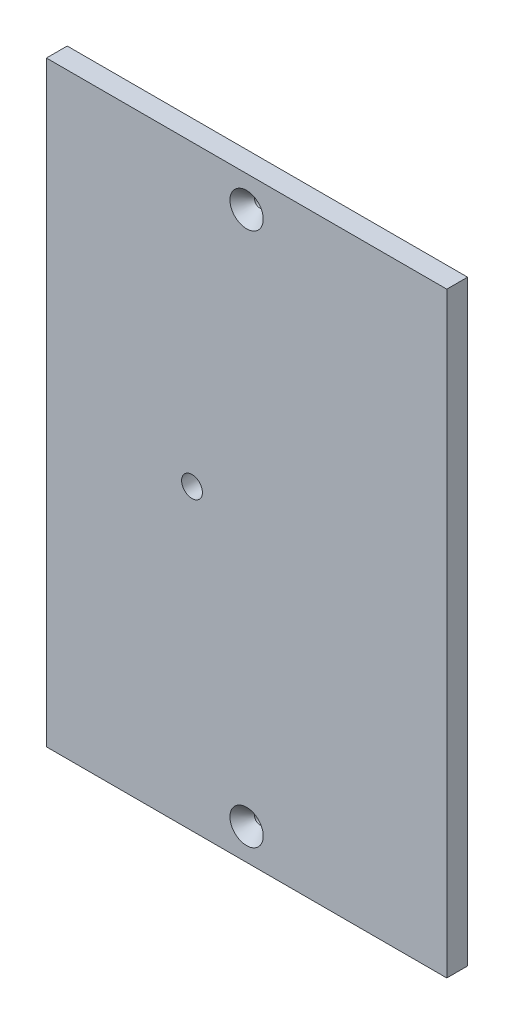
ISO-10303-21;
HEADER;
FILE_DESCRIPTION(('STEP AP214'),'2;1');
FILE_NAME('part.step','',(''),(''),'','','');
FILE_SCHEMA(('AUTOMOTIVE_DESIGN { 1 0 10303 214 1 1 1 1 }'));
ENDSEC;
DATA;
#1=APPLICATION_CONTEXT('core data for automotive mechanical design processes');
#2=APPLICATION_PROTOCOL_DEFINITION('international standard','automotive_design',2000,#1);
#3=PRODUCT_CONTEXT('',#1,'mechanical');
#4=PRODUCT('Part','Part','',(#3));
#5=PRODUCT_RELATED_PRODUCT_CATEGORY('part','',(#4));
#6=PRODUCT_DEFINITION_FORMATION('','',#4);
#7=PRODUCT_DEFINITION_CONTEXT('part definition',#1,'design');
#8=PRODUCT_DEFINITION('design','',#6,#7);
#9=PRODUCT_DEFINITION_SHAPE('','',#8);
#10=(LENGTH_UNIT() NAMED_UNIT(*) SI_UNIT(.MILLI.,.METRE.));
#11=(NAMED_UNIT(*) PLANE_ANGLE_UNIT() SI_UNIT($,.RADIAN.));
#12=(NAMED_UNIT(*) SI_UNIT($,.STERADIAN.) SOLID_ANGLE_UNIT());
#13=UNCERTAINTY_MEASURE_WITH_UNIT(LENGTH_MEASURE(1.E-05),#10,'distance_accuracy_value','');
#14=(GEOMETRIC_REPRESENTATION_CONTEXT(3) GLOBAL_UNCERTAINTY_ASSIGNED_CONTEXT((#13)) GLOBAL_UNIT_ASSIGNED_CONTEXT((#10,
#11,#12)) REPRESENTATION_CONTEXT('',''));
#15=CARTESIAN_POINT('',(0.,0.,0.));
#16=DIRECTION('',(0.,0.,1.));
#17=DIRECTION('',(1.,0.,0.));
#18=AXIS2_PLACEMENT_3D('',#15,#16,#17);
#19=CARTESIAN_POINT('',(-234.752967180657,19.0500000000001,6.34999999999963));
#20=DIRECTION('',(0.,-1.,0.));
#21=DIRECTION('',(0.999999999999994,0.,0.));
#22=AXIS2_PLACEMENT_3D('',#19,#20,#21);
#23=PLANE('',#22);
#24=DIRECTION('',(-0.999999999999994,0.,0.));
#25=VECTOR('',#24,1.);
#26=CARTESIAN_POINT('',(-234.752967180658,19.0499999999998,-6.66133814775094E-13));
#27=LINE('',#26,#25);
#28=CARTESIAN_POINT('',(-234.752967180658,19.0499999999998,-6.66133814775094E-13));
#29=VERTEX_POINT('',#28);
#30=CARTESIAN_POINT('',(-356.990829294277,19.0499999999998,-2.22044604925031E-13));
#31=VERTEX_POINT('',#30);
#32=EDGE_CURVE('E102',#29,#31,#27,.T.);
#33=ORIENTED_EDGE('',*,*,#32,.T.);
#34=DIRECTION('',(0.,0.,-0.999999999999998));
#35=VECTOR('',#34,1.);
#36=CARTESIAN_POINT('',(-356.990829294277,19.0499999999998,6.34999999999963));
#37=LINE('',#36,#35);
#38=CARTESIAN_POINT('',(-356.990829294277,19.0499999999998,6.34999999999963));
#39=VERTEX_POINT('',#38);
#40=EDGE_CURVE('E11',#39,#31,#37,.T.);
#41=ORIENTED_EDGE('',*,*,#40,.F.);
#42=DIRECTION('',(-0.999999999999994,0.,0.));
#43=VECTOR('',#42,1.);
#44=CARTESIAN_POINT('',(-234.752967180657,19.0500000000001,6.34999999999963));
#45=LINE('',#44,#43);
#46=CARTESIAN_POINT('',(-234.752967180657,19.0500000000001,6.34999999999963));
#47=VERTEX_POINT('',#46);
#48=EDGE_CURVE('E87',#47,#39,#45,.T.);
#49=ORIENTED_EDGE('',*,*,#48,.F.);
#50=DIRECTION('',(0.,0.,-0.999999999999998));
#51=VECTOR('',#50,1.);
#52=CARTESIAN_POINT('',(-234.752967180657,19.0500000000001,6.34999999999963));
#53=LINE('',#52,#51);
#54=EDGE_CURVE('E54',#47,#29,#53,.T.);
#55=ORIENTED_EDGE('',*,*,#54,.T.);
#56=EDGE_LOOP('',(#33,#41,#49,#55));
#57=FACE_BOUND('',#56,.T.);
#58=ADVANCED_FACE('F36',(#57),#23,.F.);
#59=CARTESIAN_POINT('',(-356.990829294277,19.0499999999998,6.34999999999963));
#60=DIRECTION('',(0.999999999999994,0.,0.));
#61=DIRECTION('',(0.,1.,0.));
#62=AXIS2_PLACEMENT_3D('',#59,#60,#61);
#63=PLANE('',#62);
#64=DIRECTION('',(0.,-1.,0.));
#65=VECTOR('',#64,1.);
#66=CARTESIAN_POINT('',(-356.990829294277,19.0499999999998,-2.22044604925031E-13));
#67=LINE('',#66,#65);
#68=CARTESIAN_POINT('',(-356.990829294278,-163.099999994006,-1.55431223447522E-12));
#69=VERTEX_POINT('',#68);
#70=EDGE_CURVE('E92',#31,#69,#67,.T.);
#71=ORIENTED_EDGE('',*,*,#70,.T.);
#72=DIRECTION('',(0.,0.,-0.999999999999998));
#73=VECTOR('',#72,1.);
#74=CARTESIAN_POINT('',(-356.990829294278,-163.099999994006,6.34999999999764));
#75=LINE('',#74,#73);
#76=CARTESIAN_POINT('',(-356.990829294278,-163.099999994006,6.34999999999764));
#77=VERTEX_POINT('',#76);
#78=EDGE_CURVE('E45',#77,#69,#75,.T.);
#79=ORIENTED_EDGE('',*,*,#78,.F.);
#80=DIRECTION('',(0.,-1.,0.));
#81=VECTOR('',#80,1.);
#82=CARTESIAN_POINT('',(-356.990829294277,19.0499999999998,6.34999999999963));
#83=LINE('',#82,#81);
#84=EDGE_CURVE('E79',#39,#77,#83,.T.);
#85=ORIENTED_EDGE('',*,*,#84,.F.);
#86=ORIENTED_EDGE('',*,*,#40,.T.);
#87=EDGE_LOOP('',(#71,#79,#85,#86));
#88=FACE_BOUND('',#87,.T.);
#89=ADVANCED_FACE('F91',(#88),#63,.F.);
#90=CARTESIAN_POINT('',(-234.752967180657,-163.099999994006,6.34999999999875));
#91=DIRECTION('',(0.,-1.,0.));
#92=DIRECTION('',(0.999999999999994,0.,0.));
#93=AXIS2_PLACEMENT_3D('',#90,#91,#92);
#94=PLANE('',#93);
#95=DIRECTION('',(-0.999999999999994,0.,0.));
#96=VECTOR('',#95,1.);
#97=CARTESIAN_POINT('',(-234.752967180657,-163.099999994006,-1.33226762955019E-12));
#98=LINE('',#97,#96);
#99=CARTESIAN_POINT('',(-234.752967180657,-163.099999994006,-1.33226762955019E-12));
#100=VERTEX_POINT('',#99);
#101=EDGE_CURVE('E106',#100,#69,#98,.T.);
#102=ORIENTED_EDGE('',*,*,#101,.F.);
#103=DIRECTION('',(0.,0.,-0.999999999999998));
#104=VECTOR('',#103,1.);
#105=CARTESIAN_POINT('',(-234.752967180657,-163.099999994006,6.34999999999875));
#106=LINE('',#105,#104);
#107=CARTESIAN_POINT('',(-234.752967180657,-163.099999994006,6.34999999999875));
#108=VERTEX_POINT('',#107);
#109=EDGE_CURVE('E68',#108,#100,#106,.T.);
#110=ORIENTED_EDGE('',*,*,#109,.F.);
#111=DIRECTION('',(-0.999999999999994,0.,0.));
#112=VECTOR('',#111,1.);
#113=CARTESIAN_POINT('',(-234.752967180657,-163.099999994006,6.34999999999875));
#114=LINE('',#113,#112);
#115=EDGE_CURVE('E86',#108,#77,#114,.T.);
#116=ORIENTED_EDGE('',*,*,#115,.T.);
#117=ORIENTED_EDGE('',*,*,#78,.T.);
#118=EDGE_LOOP('',(#102,#110,#116,#117));
#119=FACE_BOUND('',#118,.T.);
#120=ADVANCED_FACE('F96',(#119),#94,.T.);
#121=CARTESIAN_POINT('',(-234.752967180657,19.0500000000001,6.34999999999963));
#122=DIRECTION('',(0.999999999999994,0.,0.));
#123=DIRECTION('',(0.,1.,0.));
#124=AXIS2_PLACEMENT_3D('',#121,#122,#123);
#125=PLANE('',#124);
#126=DIRECTION('',(0.,-1.,0.));
#127=VECTOR('',#126,1.);
#128=CARTESIAN_POINT('',(-234.752967180658,19.0499999999998,-6.66133814775094E-13));
#129=LINE('',#128,#127);
#130=EDGE_CURVE('E108',#29,#100,#129,.T.);
#131=ORIENTED_EDGE('',*,*,#130,.F.);
#132=ORIENTED_EDGE('',*,*,#54,.F.);
#133=DIRECTION('',(0.,-1.,0.));
#134=VECTOR('',#133,1.);
#135=CARTESIAN_POINT('',(-234.752967180657,19.0500000000001,6.34999999999963));
#136=LINE('',#135,#134);
#137=EDGE_CURVE('E97',#47,#108,#136,.T.);
#138=ORIENTED_EDGE('',*,*,#137,.T.);
#139=ORIENTED_EDGE('',*,*,#109,.T.);
#140=EDGE_LOOP('',(#131,#132,#138,#139));
#141=FACE_BOUND('',#140,.T.);
#142=ADVANCED_FACE('F143',(#141),#125,.T.);
#143=CARTESIAN_POINT('',(0.,2.4980018054066E-13,6.34999999999919));
#144=DIRECTION('',(0.,0.,0.999999999999998));
#145=DIRECTION('',(0.999999999999994,0.,0.));
#146=AXIS2_PLACEMENT_3D('',#143,#144,#145);
#147=PLANE('',#146);
#148=CARTESIAN_POINT('',(-295.871898237467,9.52499999999994,6.34999999999919));
#149=DIRECTION('',(0.,0.,0.999999999999998));
#150=DIRECTION('',(0.999999999999994,0.,0.));
#151=AXIS2_PLACEMENT_3D('',#148,#149,#150);
#152=CIRCLE('',#151,5.08000000000003);
#153=CARTESIAN_POINT('',(-290.791898237467,9.52499999999993,6.3499999999992));
#154=VERTEX_POINT('',#153);
#155=EDGE_CURVE('E233',#154,#154,#152,.T.);
#156=ORIENTED_EDGE('',*,*,#155,.F.);
#157=EDGE_LOOP('',(#156));
#158=FACE_BOUND('',#157,.T.);
#159=CARTESIAN_POINT('',(-295.871898237468,-153.574999994006,6.34999999999741));
#160=DIRECTION('',(0.,0.,0.999999999999998));
#161=DIRECTION('',(0.999999999999994,0.,0.));
#162=AXIS2_PLACEMENT_3D('',#159,#160,#161);
#163=CIRCLE('',#162,5.07999999999997);
#164=CARTESIAN_POINT('',(-290.791898237468,-153.574999994006,6.34999999999742));
#165=VERTEX_POINT('',#164);
#166=EDGE_CURVE('E121',#165,#165,#163,.T.);
#167=ORIENTED_EDGE('',*,*,#166,.F.);
#168=EDGE_LOOP('',(#167));
#169=FACE_BOUND('',#168,.T.);
#170=CARTESIAN_POINT('',(-312.540829294267,-72.0249999970012,6.34999999999963));
#171=DIRECTION('',(0.,0.,0.999999999999998));
#172=DIRECTION('',(0.999999999999994,0.,0.));
#173=AXIS2_PLACEMENT_3D('',#170,#171,#172);
#174=CIRCLE('',#173,3.17499999999998);
#175=CARTESIAN_POINT('',(-309.365829294267,-72.0249999970012,6.34999999999964));
#176=VERTEX_POINT('',#175);
#177=EDGE_CURVE('E114',#176,#176,#174,.T.);
#178=ORIENTED_EDGE('',*,*,#177,.F.);
#179=EDGE_LOOP('',(#178));
#180=FACE_BOUND('',#179,.T.);
#181=ORIENTED_EDGE('',*,*,#48,.T.);
#182=ORIENTED_EDGE('',*,*,#84,.T.);
#183=ORIENTED_EDGE('',*,*,#115,.F.);
#184=ORIENTED_EDGE('',*,*,#137,.F.);
#185=EDGE_LOOP('',(#181,#182,#183,#184));
#186=FACE_BOUND('',#185,.T.);
#187=ADVANCED_FACE('F83',(#158,#169,#180,#186),#147,.T.);
#188=CARTESIAN_POINT('',(0.,0.,0.));
#189=DIRECTION('',(0.,0.,0.999999999999998));
#190=DIRECTION('',(0.999999999999994,0.,0.));
#191=AXIS2_PLACEMENT_3D('',#188,#189,#190);
#192=PLANE('',#191);
#193=CARTESIAN_POINT('',(-295.871898237468,9.52499999999987,-6.66133814775094E-13));
#194=DIRECTION('',(0.,0.,0.999999999999998));
#195=DIRECTION('',(0.999999999999994,0.,0.));
#196=AXIS2_PLACEMENT_3D('',#193,#194,#195);
#197=CIRCLE('',#196,1.58750000000002);
#198=CARTESIAN_POINT('',(-294.284398237468,9.52499999999987,-6.64106963865763E-13));
#199=VERTEX_POINT('',#198);
#200=EDGE_CURVE('E39',#199,#199,#197,.T.);
#201=ORIENTED_EDGE('',*,*,#200,.T.);
#202=EDGE_LOOP('',(#201));
#203=FACE_BOUND('',#202,.T.);
#204=CARTESIAN_POINT('',(-295.871898237468,-153.574999994006,-6.66133814775094E-13));
#205=DIRECTION('',(0.,0.,0.999999999999998));
#206=DIRECTION('',(0.999999999999994,0.,0.));
#207=AXIS2_PLACEMENT_3D('',#204,#205,#206);
#208=CIRCLE('',#207,1.58750000000002);
#209=CARTESIAN_POINT('',(-294.284398237468,-153.574999994006,-6.64106963865763E-13));
#210=VERTEX_POINT('',#209);
#211=EDGE_CURVE('E112',#210,#210,#208,.T.);
#212=ORIENTED_EDGE('',*,*,#211,.T.);
#213=EDGE_LOOP('',(#212));
#214=FACE_BOUND('',#213,.T.);
#215=CARTESIAN_POINT('',(-312.540829294267,-72.0249999970013,-1.11022302462516E-12));
#216=DIRECTION('',(0.,0.,0.999999999999998));
#217=DIRECTION('',(0.999999999999994,0.,0.));
#218=AXIS2_PLACEMENT_3D('',#215,#216,#217);
#219=CIRCLE('',#218,3.17499999999993);
#220=CARTESIAN_POINT('',(-309.365829294267,-72.0249999970013,-1.10616932280649E-12));
#221=VERTEX_POINT('',#220);
#222=EDGE_CURVE('E104',#221,#221,#219,.T.);
#223=ORIENTED_EDGE('',*,*,#222,.T.);
#224=EDGE_LOOP('',(#223));
#225=FACE_BOUND('',#224,.T.);
#226=ORIENTED_EDGE('',*,*,#32,.F.);
#227=ORIENTED_EDGE('',*,*,#130,.T.);
#228=ORIENTED_EDGE('',*,*,#101,.T.);
#229=ORIENTED_EDGE('',*,*,#70,.F.);
#230=EDGE_LOOP('',(#226,#227,#228,#229));
#231=FACE_BOUND('',#230,.T.);
#232=ADVANCED_FACE('F132',(#203,#214,#225,#231),#192,.F.);
#233=CARTESIAN_POINT('',(-312.540829294267,-72.0249999970012,6.34999999999963));
#234=DIRECTION('',(0.,0.,0.999999999999998));
#235=DIRECTION('',(0.999999999999994,0.,0.));
#236=AXIS2_PLACEMENT_3D('',#233,#234,#235);
#237=CYLINDRICAL_SURFACE('',#236,3.17499999999996);
#238=ORIENTED_EDGE('',*,*,#222,.F.);
#239=EDGE_LOOP('',(#238));
#240=FACE_BOUND('',#239,.T.);
#241=ORIENTED_EDGE('',*,*,#177,.T.);
#242=EDGE_LOOP('',(#241));
#243=FACE_BOUND('',#242,.T.);
#244=ADVANCED_FACE('F135',(#240,#243),#237,.F.);
#245=CARTESIAN_POINT('',(-295.871898237468,-153.574999994006,6.34999999999741));
#246=DIRECTION('',(0.,0.,0.999999999999998));
#247=DIRECTION('',(0.999999999999994,0.,0.));
#248=AXIS2_PLACEMENT_3D('',#245,#246,#247);
#249=CYLINDRICAL_SURFACE('',#248,1.58750000000002);
#250=CARTESIAN_POINT('',(-295.871898237468,-153.574999994006,2.33233833777846));
#251=DIRECTION('',(0.,0.,0.999999999999998));
#252=DIRECTION('',(0.999999999999994,0.,0.));
#253=AXIS2_PLACEMENT_3D('',#250,#251,#252);
#254=CIRCLE('',#253,1.58750000000002);
#255=CARTESIAN_POINT('',(-294.284398237468,-153.574999994006,2.33233833777846));
#256=VERTEX_POINT('',#255);
#257=EDGE_CURVE('E115',#256,#256,#254,.T.);
#258=ORIENTED_EDGE('',*,*,#257,.T.);
#259=EDGE_LOOP('',(#258));
#260=FACE_BOUND('',#259,.T.);
#261=ORIENTED_EDGE('',*,*,#211,.F.);
#262=EDGE_LOOP('',(#261));
#263=FACE_BOUND('',#262,.T.);
#264=ADVANCED_FACE('F138',(#260,#263),#249,.F.);
#265=CARTESIAN_POINT('',(-295.871898237468,-153.574999994006,6.34999999999741));
#266=DIRECTION('',(0.,0.,0.999999999999998));
#267=DIRECTION('',(0.999999999999994,0.,0.));
#268=AXIS2_PLACEMENT_3D('',#265,#266,#267);
#269=CONICAL_SURFACE('',#268,5.07999999999997,0.71558499331767);
#270=ORIENTED_EDGE('',*,*,#257,.F.);
#271=EDGE_LOOP('',(#270));
#272=FACE_BOUND('',#271,.T.);
#273=ORIENTED_EDGE('',*,*,#166,.T.);
#274=EDGE_LOOP('',(#273));
#275=FACE_BOUND('',#274,.T.);
#276=ADVANCED_FACE('F195',(#272,#275),#269,.F.);
#277=CARTESIAN_POINT('',(-295.871898237467,9.52499999999994,6.34999999999919));
#278=DIRECTION('',(0.,0.,0.999999999999998));
#279=DIRECTION('',(0.999999999999994,0.,0.));
#280=AXIS2_PLACEMENT_3D('',#277,#278,#279);
#281=CYLINDRICAL_SURFACE('',#280,1.58750000000002);
#282=CARTESIAN_POINT('',(-295.871898237466,9.52499999999991,2.33233833777957));
#283=DIRECTION('',(0.,0.,0.999999999999998));
#284=DIRECTION('',(0.999999999999994,0.,0.));
#285=AXIS2_PLACEMENT_3D('',#282,#283,#284);
#286=CIRCLE('',#285,1.58750000000002);
#287=CARTESIAN_POINT('',(-294.284398237466,9.52499999999991,2.33233833777957));
#288=VERTEX_POINT('',#287);
#289=EDGE_CURVE('E231',#288,#288,#286,.T.);
#290=ORIENTED_EDGE('',*,*,#289,.T.);
#291=EDGE_LOOP('',(#290));
#292=FACE_BOUND('',#291,.T.);
#293=ORIENTED_EDGE('',*,*,#200,.F.);
#294=EDGE_LOOP('',(#293));
#295=FACE_BOUND('',#294,.T.);
#296=ADVANCED_FACE('F204',(#292,#295),#281,.F.);
#297=CARTESIAN_POINT('',(-295.871898237467,9.52499999999994,6.34999999999919));
#298=DIRECTION('',(0.,0.,0.999999999999998));
#299=DIRECTION('',(0.999999999999994,0.,0.));
#300=AXIS2_PLACEMENT_3D('',#297,#298,#299);
#301=CONICAL_SURFACE('',#300,5.08000000000003,0.715584993317678);
#302=ORIENTED_EDGE('',*,*,#289,.F.);
#303=EDGE_LOOP('',(#302));
#304=FACE_BOUND('',#303,.T.);
#305=ORIENTED_EDGE('',*,*,#155,.T.);
#306=EDGE_LOOP('',(#305));
#307=FACE_BOUND('',#306,.T.);
#308=ADVANCED_FACE('F214',(#304,#307),#301,.F.);
#309=CLOSED_SHELL('',(#58,#89,#120,#142,#187,#232,#244,#264,#276,#296,#308));
#310=MANIFOLD_SOLID_BREP('B2',#309);
#311=ADVANCED_BREP_SHAPE_REPRESENTATION('',(#18,#310),#14);
#312=SHAPE_DEFINITION_REPRESENTATION(#9,#311);
ENDSEC;
END-ISO-10303-21;
